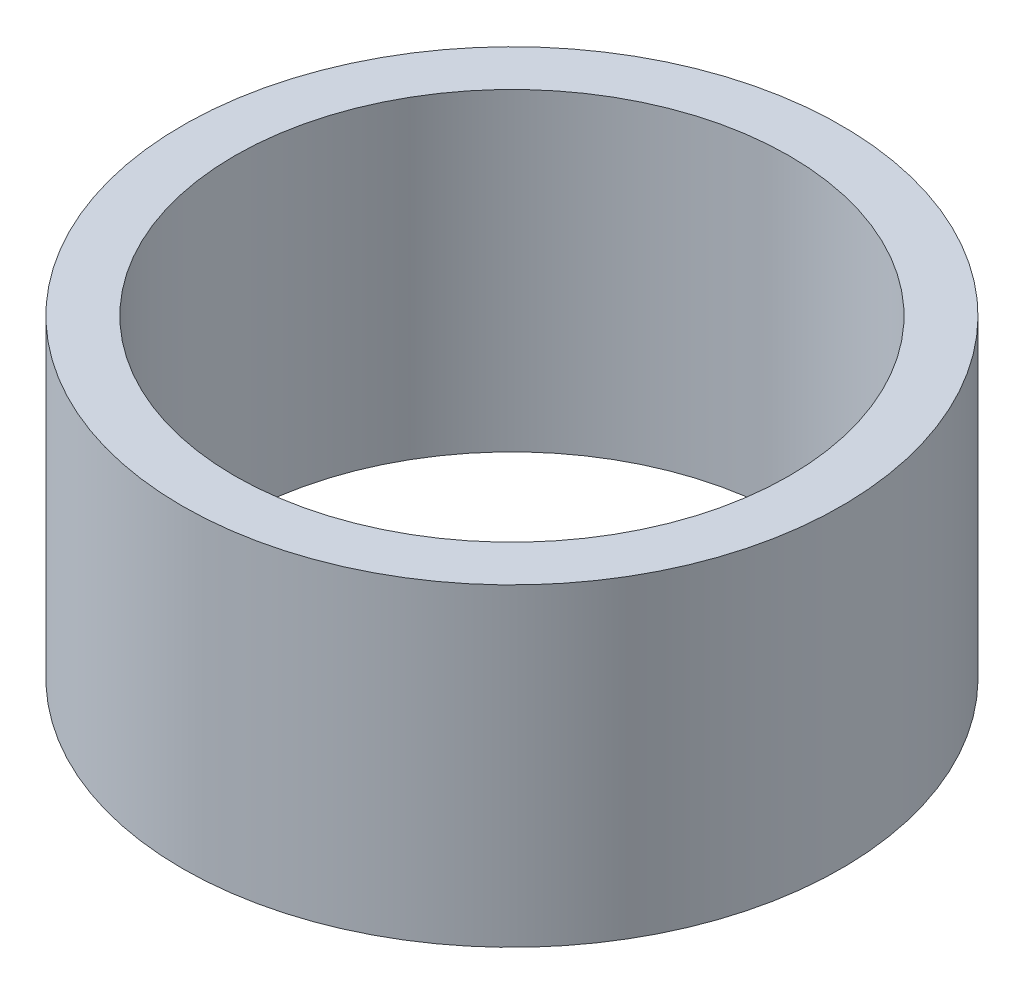
ISO-10303-21;
HEADER;
FILE_DESCRIPTION(('STEP AP214'),'2;1');
FILE_NAME('part.step','',(''),(''),'','','');
FILE_SCHEMA(('AUTOMOTIVE_DESIGN { 1 0 10303 214 1 1 1 1 }'));
ENDSEC;
DATA;
#1=APPLICATION_CONTEXT('core data for automotive mechanical design processes');
#2=APPLICATION_PROTOCOL_DEFINITION('international standard','automotive_design',2000,#1);
#3=PRODUCT_CONTEXT('',#1,'mechanical');
#4=PRODUCT('Part','Part','',(#3));
#5=PRODUCT_RELATED_PRODUCT_CATEGORY('part','',(#4));
#6=PRODUCT_DEFINITION_FORMATION('','',#4);
#7=PRODUCT_DEFINITION_CONTEXT('part definition',#1,'design');
#8=PRODUCT_DEFINITION('design','',#6,#7);
#9=PRODUCT_DEFINITION_SHAPE('','',#8);
#10=(LENGTH_UNIT() NAMED_UNIT(*) SI_UNIT(.MILLI.,.METRE.));
#11=(NAMED_UNIT(*) PLANE_ANGLE_UNIT() SI_UNIT($,.RADIAN.));
#12=(NAMED_UNIT(*) SI_UNIT($,.STERADIAN.) SOLID_ANGLE_UNIT());
#13=UNCERTAINTY_MEASURE_WITH_UNIT(LENGTH_MEASURE(1.E-05),#10,'distance_accuracy_value','');
#14=(GEOMETRIC_REPRESENTATION_CONTEXT(3) GLOBAL_UNCERTAINTY_ASSIGNED_CONTEXT((#13)) GLOBAL_UNIT_ASSIGNED_CONTEXT((#10,
#11,#12)) REPRESENTATION_CONTEXT('',''));
#15=CARTESIAN_POINT('',(0.,0.,0.));
#16=DIRECTION('',(0.,0.,1.));
#17=DIRECTION('',(1.,0.,0.));
#18=AXIS2_PLACEMENT_3D('',#15,#16,#17);
#19=CARTESIAN_POINT('',(0.,3.,0.));
#20=DIRECTION('',(0.,1.,0.));
#21=DIRECTION('',(0.,0.,1.));
#22=AXIS2_PLACEMENT_3D('',#19,#20,#21);
#23=PLANE('',#22);
#24=CARTESIAN_POINT('',(0.,3.,0.));
#25=DIRECTION('',(0.,1.,0.));
#26=DIRECTION('',(0.,0.,1.));
#27=AXIS2_PLACEMENT_3D('',#24,#25,#26);
#28=CIRCLE('',#27,6.3);
#29=CARTESIAN_POINT('',(0.,3.,6.3));
#30=VERTEX_POINT('',#29);
#31=EDGE_CURVE('E10',#30,#30,#28,.T.);
#32=ORIENTED_EDGE('',*,*,#31,.T.);
#33=EDGE_LOOP('',(#32));
#34=FACE_BOUND('',#33,.T.);
#35=CARTESIAN_POINT('',(0.,3.,0.));
#36=DIRECTION('',(0.,1.,0.));
#37=DIRECTION('',(0.,0.,1.));
#38=AXIS2_PLACEMENT_3D('',#35,#36,#37);
#39=CIRCLE('',#38,5.3);
#40=CARTESIAN_POINT('',(0.,3.,5.3));
#41=VERTEX_POINT('',#40);
#42=EDGE_CURVE('E48',#41,#41,#39,.T.);
#43=ORIENTED_EDGE('',*,*,#42,.F.);
#44=EDGE_LOOP('',(#43));
#45=FACE_BOUND('',#44,.T.);
#46=ADVANCED_FACE('F37',(#34,#45),#23,.T.);
#47=CARTESIAN_POINT('',(0.,-3.,0.));
#48=DIRECTION('',(0.,1.,0.));
#49=DIRECTION('',(0.,0.,1.));
#50=AXIS2_PLACEMENT_3D('',#47,#48,#49);
#51=PLANE('',#50);
#52=CARTESIAN_POINT('',(0.,-3.,0.));
#53=DIRECTION('',(0.,1.,0.));
#54=DIRECTION('',(0.,0.,1.));
#55=AXIS2_PLACEMENT_3D('',#52,#53,#54);
#56=CIRCLE('',#55,6.3);
#57=CARTESIAN_POINT('',(0.,-3.,6.3));
#58=VERTEX_POINT('',#57);
#59=EDGE_CURVE('E41',#58,#58,#56,.T.);
#60=ORIENTED_EDGE('',*,*,#59,.F.);
#61=EDGE_LOOP('',(#60));
#62=FACE_BOUND('',#61,.T.);
#63=CARTESIAN_POINT('',(0.,-3.,0.));
#64=DIRECTION('',(0.,1.,0.));
#65=DIRECTION('',(0.,0.,1.));
#66=AXIS2_PLACEMENT_3D('',#63,#64,#65);
#67=CIRCLE('',#66,5.3);
#68=CARTESIAN_POINT('',(0.,-3.,5.3));
#69=VERTEX_POINT('',#68);
#70=EDGE_CURVE('E50',#69,#69,#67,.T.);
#71=ORIENTED_EDGE('',*,*,#70,.T.);
#72=EDGE_LOOP('',(#71));
#73=FACE_BOUND('',#72,.T.);
#74=ADVANCED_FACE('F60',(#62,#73),#51,.F.);
#75=CARTESIAN_POINT('',(0.,3.,0.));
#76=DIRECTION('',(0.,-1.,0.));
#77=DIRECTION('',(0.,0.,-1.));
#78=AXIS2_PLACEMENT_3D('',#75,#76,#77);
#79=CYLINDRICAL_SURFACE('',#78,6.3);
#80=ORIENTED_EDGE('',*,*,#31,.F.);
#81=EDGE_LOOP('',(#80));
#82=FACE_BOUND('',#81,.T.);
#83=ORIENTED_EDGE('',*,*,#59,.T.);
#84=EDGE_LOOP('',(#83));
#85=FACE_BOUND('',#84,.T.);
#86=ADVANCED_FACE('F39',(#82,#85),#79,.T.);
#87=CARTESIAN_POINT('',(0.,3.,0.));
#88=DIRECTION('',(0.,-1.,0.));
#89=DIRECTION('',(0.,0.,-1.));
#90=AXIS2_PLACEMENT_3D('',#87,#88,#89);
#91=CYLINDRICAL_SURFACE('',#90,5.3);
#92=ORIENTED_EDGE('',*,*,#42,.T.);
#93=EDGE_LOOP('',(#92));
#94=FACE_BOUND('',#93,.T.);
#95=ORIENTED_EDGE('',*,*,#70,.F.);
#96=EDGE_LOOP('',(#95));
#97=FACE_BOUND('',#96,.T.);
#98=ADVANCED_FACE('F56',(#94,#97),#91,.F.);
#99=CLOSED_SHELL('',(#46,#74,#86,#98));
#100=MANIFOLD_SOLID_BREP('B2',#99);
#101=ADVANCED_BREP_SHAPE_REPRESENTATION('',(#18,#100),#14);
#102=SHAPE_DEFINITION_REPRESENTATION(#9,#101);
ENDSEC;
END-ISO-10303-21;
